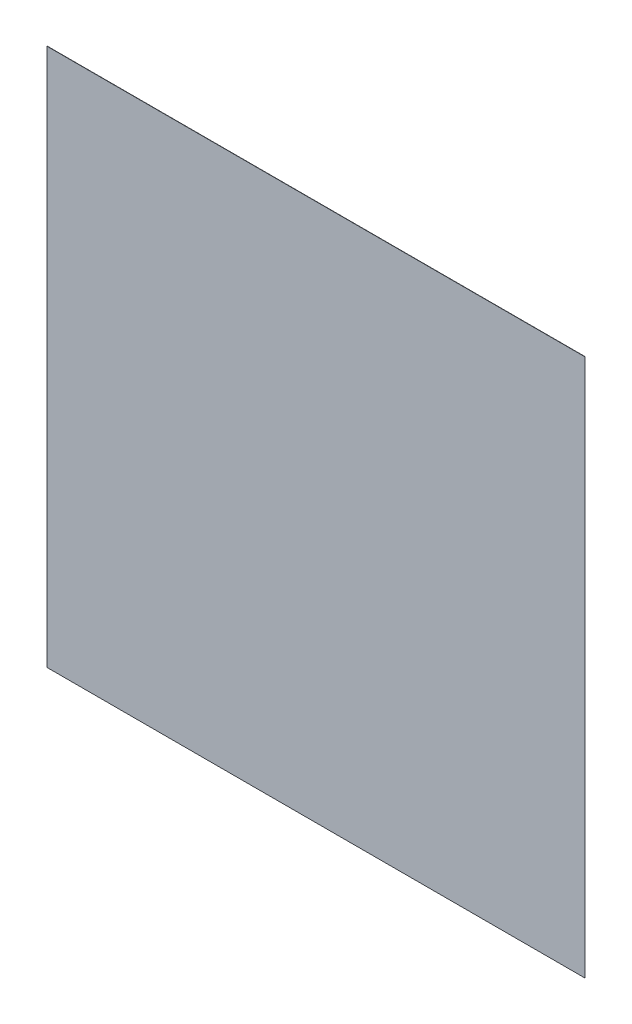
ISO-10303-21;
HEADER;
FILE_DESCRIPTION(('STEP AP214'),'2;1');
FILE_NAME('part.step','',(''),(''),'','','');
FILE_SCHEMA(('AUTOMOTIVE_DESIGN { 1 0 10303 214 1 1 1 1 }'));
ENDSEC;
DATA;
#1=APPLICATION_CONTEXT('core data for automotive mechanical design processes');
#2=APPLICATION_PROTOCOL_DEFINITION('international standard','automotive_design',2000,#1);
#3=PRODUCT_CONTEXT('',#1,'mechanical');
#4=PRODUCT('Part','Part','',(#3));
#5=PRODUCT_RELATED_PRODUCT_CATEGORY('part','',(#4));
#6=PRODUCT_DEFINITION_FORMATION('','',#4);
#7=PRODUCT_DEFINITION_CONTEXT('part definition',#1,'design');
#8=PRODUCT_DEFINITION('design','',#6,#7);
#9=PRODUCT_DEFINITION_SHAPE('','',#8);
#10=(LENGTH_UNIT() NAMED_UNIT(*) SI_UNIT(.MILLI.,.METRE.));
#11=(NAMED_UNIT(*) PLANE_ANGLE_UNIT() SI_UNIT($,.RADIAN.));
#12=(NAMED_UNIT(*) SI_UNIT($,.STERADIAN.) SOLID_ANGLE_UNIT());
#13=UNCERTAINTY_MEASURE_WITH_UNIT(LENGTH_MEASURE(1.E-05),#10,'distance_accuracy_value','');
#14=(GEOMETRIC_REPRESENTATION_CONTEXT(3) GLOBAL_UNCERTAINTY_ASSIGNED_CONTEXT((#13)) GLOBAL_UNIT_ASSIGNED_CONTEXT((#10,
#11,#12)) REPRESENTATION_CONTEXT('',''));
#15=CARTESIAN_POINT('',(0.,0.,0.));
#16=DIRECTION('',(0.,0.,1.));
#17=DIRECTION('',(1.,0.,0.));
#18=AXIS2_PLACEMENT_3D('',#15,#16,#17);
#19=CARTESIAN_POINT('',(0.,1362.87896832242,1.));
#20=DIRECTION('',(1.,0.,0.));
#21=DIRECTION('',(0.,0.,-1.));
#22=AXIS2_PLACEMENT_3D('',#19,#20,#21);
#23=PLANE('',#22);
#24=DIRECTION('',(0.,-1.,0.));
#25=VECTOR('',#24,1.);
#26=CARTESIAN_POINT('',(0.,1362.87896832242,0.));
#27=LINE('',#26,#25);
#28=CARTESIAN_POINT('',(0.,1362.87896832242,0.));
#29=VERTEX_POINT('',#28);
#30=CARTESIAN_POINT('',(0.,-637.121031677583,0.));
#31=VERTEX_POINT('',#30);
#32=EDGE_CURVE('E103',#29,#31,#27,.T.);
#33=ORIENTED_EDGE('',*,*,#32,.T.);
#34=DIRECTION('',(0.,0.,-1.));
#35=VECTOR('',#34,1.);
#36=CARTESIAN_POINT('',(0.,-637.121031677583,1.));
#37=LINE('',#36,#35);
#38=CARTESIAN_POINT('',(0.,-637.121031677583,1.));
#39=VERTEX_POINT('',#38);
#40=EDGE_CURVE('E11',#39,#31,#37,.T.);
#41=ORIENTED_EDGE('',*,*,#40,.F.);
#42=DIRECTION('',(0.,-1.,0.));
#43=VECTOR('',#42,1.);
#44=CARTESIAN_POINT('',(0.,1362.87896832242,1.));
#45=LINE('',#44,#43);
#46=CARTESIAN_POINT('',(0.,1362.87896832242,1.));
#47=VERTEX_POINT('',#46);
#48=EDGE_CURVE('E91',#47,#39,#45,.T.);
#49=ORIENTED_EDGE('',*,*,#48,.F.);
#50=DIRECTION('',(0.,0.,-1.));
#51=VECTOR('',#50,1.);
#52=CARTESIAN_POINT('',(0.,1362.87896832242,1.));
#53=LINE('',#52,#51);
#54=EDGE_CURVE('E99',#47,#29,#53,.T.);
#55=ORIENTED_EDGE('',*,*,#54,.T.);
#56=EDGE_LOOP('',(#33,#41,#49,#55));
#57=FACE_BOUND('',#56,.T.);
#58=ADVANCED_FACE('F40',(#57),#23,.F.);
#59=CARTESIAN_POINT('',(0.,-637.121031677583,1.));
#60=DIRECTION('',(0.,1.,0.));
#61=DIRECTION('',(0.,0.,1.));
#62=AXIS2_PLACEMENT_3D('',#59,#60,#61);
#63=PLANE('',#62);
#64=DIRECTION('',(1.,0.,0.));
#65=VECTOR('',#64,1.);
#66=CARTESIAN_POINT('',(0.,-637.121031677583,0.));
#67=LINE('',#66,#65);
#68=CARTESIAN_POINT('',(2000.,-637.121031677583,0.));
#69=VERTEX_POINT('',#68);
#70=EDGE_CURVE('E95',#31,#69,#67,.T.);
#71=ORIENTED_EDGE('',*,*,#70,.T.);
#72=DIRECTION('',(0.,0.,-1.));
#73=VECTOR('',#72,1.);
#74=CARTESIAN_POINT('',(2000.,-637.121031677583,1.));
#75=LINE('',#74,#73);
#76=CARTESIAN_POINT('',(2000.,-637.121031677583,1.));
#77=VERTEX_POINT('',#76);
#78=EDGE_CURVE('E48',#77,#69,#75,.T.);
#79=ORIENTED_EDGE('',*,*,#78,.F.);
#80=DIRECTION('',(1.,0.,0.));
#81=VECTOR('',#80,1.);
#82=CARTESIAN_POINT('',(0.,-637.121031677583,1.));
#83=LINE('',#82,#81);
#84=EDGE_CURVE('E86',#39,#77,#83,.T.);
#85=ORIENTED_EDGE('',*,*,#84,.F.);
#86=ORIENTED_EDGE('',*,*,#40,.T.);
#87=EDGE_LOOP('',(#71,#79,#85,#86));
#88=FACE_BOUND('',#87,.T.);
#89=ADVANCED_FACE('F94',(#88),#63,.F.);
#90=CARTESIAN_POINT('',(2000.,1362.87896832242,1.));
#91=DIRECTION('',(-1.,0.,0.));
#92=DIRECTION('',(0.,0.,1.));
#93=AXIS2_PLACEMENT_3D('',#90,#91,#92);
#94=PLANE('',#93);
#95=DIRECTION('',(0.,1.,0.));
#96=VECTOR('',#95,1.);
#97=CARTESIAN_POINT('',(2000.,1362.87896832242,0.));
#98=LINE('',#97,#96);
#99=CARTESIAN_POINT('',(2000.,1362.87896832242,0.));
#100=VERTEX_POINT('',#99);
#101=EDGE_CURVE('E73',#69,#100,#98,.T.);
#102=ORIENTED_EDGE('',*,*,#101,.T.);
#103=DIRECTION('',(0.,0.,-1.));
#104=VECTOR('',#103,1.);
#105=CARTESIAN_POINT('',(2000.,1362.87896832242,1.));
#106=LINE('',#105,#104);
#107=CARTESIAN_POINT('',(2000.,1362.87896832242,1.));
#108=VERTEX_POINT('',#107);
#109=EDGE_CURVE('E96',#108,#100,#106,.T.);
#110=ORIENTED_EDGE('',*,*,#109,.F.);
#111=DIRECTION('',(0.,1.,0.));
#112=VECTOR('',#111,1.);
#113=CARTESIAN_POINT('',(2000.,1362.87896832242,1.));
#114=LINE('',#113,#112);
#115=EDGE_CURVE('E89',#77,#108,#114,.T.);
#116=ORIENTED_EDGE('',*,*,#115,.F.);
#117=ORIENTED_EDGE('',*,*,#78,.T.);
#118=EDGE_LOOP('',(#102,#110,#116,#117));
#119=FACE_BOUND('',#118,.T.);
#120=ADVANCED_FACE('F97',(#119),#94,.F.);
#121=CARTESIAN_POINT('',(0.,1362.87896832242,1.));
#122=DIRECTION('',(0.,-1.,0.));
#123=DIRECTION('',(0.,0.,-1.));
#124=AXIS2_PLACEMENT_3D('',#121,#122,#123);
#125=PLANE('',#124);
#126=DIRECTION('',(-1.,0.,0.));
#127=VECTOR('',#126,1.);
#128=CARTESIAN_POINT('',(0.,1362.87896832242,0.));
#129=LINE('',#128,#127);
#130=EDGE_CURVE('E79',#100,#29,#129,.T.);
#131=ORIENTED_EDGE('',*,*,#130,.T.);
#132=ORIENTED_EDGE('',*,*,#54,.F.);
#133=DIRECTION('',(-1.,0.,0.));
#134=VECTOR('',#133,1.);
#135=CARTESIAN_POINT('',(0.,1362.87896832242,1.));
#136=LINE('',#135,#134);
#137=EDGE_CURVE('E56',#108,#47,#136,.T.);
#138=ORIENTED_EDGE('',*,*,#137,.F.);
#139=ORIENTED_EDGE('',*,*,#109,.T.);
#140=EDGE_LOOP('',(#131,#132,#138,#139));
#141=FACE_BOUND('',#140,.T.);
#142=ADVANCED_FACE('F110',(#141),#125,.F.);
#143=CARTESIAN_POINT('',(0.,0.,1.));
#144=DIRECTION('',(0.,0.,1.));
#145=DIRECTION('',(1.,0.,0.));
#146=AXIS2_PLACEMENT_3D('',#143,#144,#145);
#147=PLANE('',#146);
#148=ORIENTED_EDGE('',*,*,#48,.T.);
#149=ORIENTED_EDGE('',*,*,#84,.T.);
#150=ORIENTED_EDGE('',*,*,#115,.T.);
#151=ORIENTED_EDGE('',*,*,#137,.T.);
#152=EDGE_LOOP('',(#148,#149,#150,#151));
#153=FACE_BOUND('',#152,.T.);
#154=ADVANCED_FACE('F87',(#153),#147,.T.);
#155=CARTESIAN_POINT('',(0.,0.,0.));
#156=DIRECTION('',(0.,0.,1.));
#157=DIRECTION('',(1.,0.,0.));
#158=AXIS2_PLACEMENT_3D('',#155,#156,#157);
#159=PLANE('',#158);
#160=ORIENTED_EDGE('',*,*,#32,.F.);
#161=ORIENTED_EDGE('',*,*,#130,.F.);
#162=ORIENTED_EDGE('',*,*,#101,.F.);
#163=ORIENTED_EDGE('',*,*,#70,.F.);
#164=EDGE_LOOP('',(#160,#161,#162,#163));
#165=FACE_BOUND('',#164,.T.);
#166=ADVANCED_FACE('F113',(#165),#159,.F.);
#167=CLOSED_SHELL('',(#58,#89,#120,#142,#154,#166));
#168=MANIFOLD_SOLID_BREP('B2',#167);
#169=ADVANCED_BREP_SHAPE_REPRESENTATION('',(#18,#168),#14);
#170=SHAPE_DEFINITION_REPRESENTATION(#9,#169);
ENDSEC;
END-ISO-10303-21;
